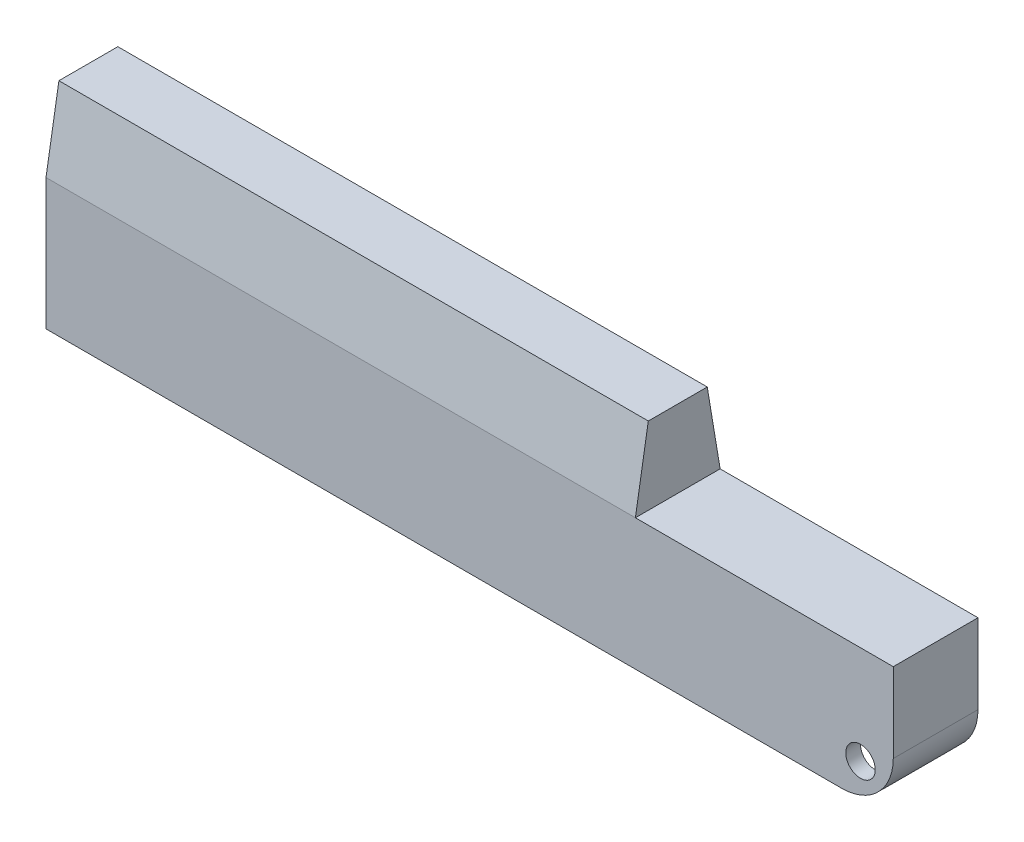
ISO-10303-21;
HEADER;
FILE_DESCRIPTION(('STEP AP214'),'2;1');
FILE_NAME('part.step','',(''),(''),'','','');
FILE_SCHEMA(('AUTOMOTIVE_DESIGN { 1 0 10303 214 1 1 1 1 }'));
ENDSEC;
DATA;
#1=APPLICATION_CONTEXT('core data for automotive mechanical design processes');
#2=APPLICATION_PROTOCOL_DEFINITION('international standard','automotive_design',2000,#1);
#3=PRODUCT_CONTEXT('',#1,'mechanical');
#4=PRODUCT('Part','Part','',(#3));
#5=PRODUCT_RELATED_PRODUCT_CATEGORY('part','',(#4));
#6=PRODUCT_DEFINITION_FORMATION('','',#4);
#7=PRODUCT_DEFINITION_CONTEXT('part definition',#1,'design');
#8=PRODUCT_DEFINITION('design','',#6,#7);
#9=PRODUCT_DEFINITION_SHAPE('','',#8);
#10=(LENGTH_UNIT() NAMED_UNIT(*) SI_UNIT(.MILLI.,.METRE.));
#11=(NAMED_UNIT(*) PLANE_ANGLE_UNIT() SI_UNIT($,.RADIAN.));
#12=(NAMED_UNIT(*) SI_UNIT($,.STERADIAN.) SOLID_ANGLE_UNIT());
#13=UNCERTAINTY_MEASURE_WITH_UNIT(LENGTH_MEASURE(1.E-05),#10,'distance_accuracy_value','');
#14=(GEOMETRIC_REPRESENTATION_CONTEXT(3) GLOBAL_UNCERTAINTY_ASSIGNED_CONTEXT((#13)) GLOBAL_UNIT_ASSIGNED_CONTEXT((#10,
#11,#12)) REPRESENTATION_CONTEXT('',''));
#15=CARTESIAN_POINT('',(0.,0.,0.));
#16=DIRECTION('',(0.,0.,1.));
#17=DIRECTION('',(1.,0.,0.));
#18=AXIS2_PLACEMENT_3D('',#15,#16,#17);
#19=CARTESIAN_POINT('',(-44.,111.253089844732,3.75));
#20=DIRECTION('',(0.,0.,1.));
#21=DIRECTION('',(1.,0.,0.));
#22=AXIS2_PLACEMENT_3D('',#19,#20,#21);
#23=PLANE('',#22);
#24=CARTESIAN_POINT('',(64.5500000000001,-13.35,3.75000000000001));
#25=DIRECTION('',(0.,0.,1.));
#26=DIRECTION('',(1.,0.,0.));
#27=AXIS2_PLACEMENT_3D('',#24,#25,#26);
#28=CIRCLE('',#27,2.);
#29=CARTESIAN_POINT('',(66.5500000000001,-13.35,3.75000000000001));
#30=VERTEX_POINT('',#29);
#31=EDGE_CURVE('E257',#30,#30,#28,.F.);
#32=ORIENTED_EDGE('',*,*,#31,.F.);
#33=EDGE_LOOP('',(#32));
#34=FACE_BOUND('',#33,.T.);
#35=DIRECTION('',(0.,-1.,0.));
#36=VECTOR('',#35,1.);
#37=CARTESIAN_POINT('',(67.,111.253089844732,3.75000000000001));
#38=LINE('',#37,#36);
#39=CARTESIAN_POINT('',(67.,-7.99999999999999,3.75000000000001));
#40=VERTEX_POINT('',#39);
#41=CARTESIAN_POINT('',(67.,-15.6989794855664,3.75000000000001));
#42=VERTEX_POINT('',#41);
#43=EDGE_CURVE('E228',#40,#42,#38,.T.);
#44=ORIENTED_EDGE('',*,*,#43,.T.);
#45=CARTESIAN_POINT('',(62.,-10.8,3.75000000000001));
#46=DIRECTION('',(0.,0.,1.));
#47=DIRECTION('',(1.,0.,0.));
#48=AXIS2_PLACEMENT_3D('',#45,#46,#47);
#49=CIRCLE('',#48,7.);
#50=CARTESIAN_POINT('',(62.,-17.8,3.75000000000001));
#51=VERTEX_POINT('',#50);
#52=EDGE_CURVE('E57',#42,#51,#49,.F.);
#53=ORIENTED_EDGE('',*,*,#52,.T.);
#54=DIRECTION('',(-1.,0.,0.));
#55=VECTOR('',#54,1.);
#56=CARTESIAN_POINT('',(-44.,-17.8,3.75));
#57=LINE('',#56,#55);
#58=CARTESIAN_POINT('',(-44.,-17.8,3.75));
#59=VERTEX_POINT('',#58);
#60=EDGE_CURVE('E191',#51,#59,#57,.T.);
#61=ORIENTED_EDGE('',*,*,#60,.T.);
#62=DIRECTION('',(0.,-1.,0.));
#63=VECTOR('',#62,1.);
#64=CARTESIAN_POINT('',(-44.,111.253089844732,3.75));
#65=LINE('',#64,#63);
#66=CARTESIAN_POINT('',(-44.,-14.3,3.75));
#67=VERTEX_POINT('',#66);
#68=EDGE_CURVE('E181',#67,#59,#65,.T.);
#69=ORIENTED_EDGE('',*,*,#68,.F.);
#70=DIRECTION('',(1.,0.,0.));
#71=VECTOR('',#70,1.);
#72=CARTESIAN_POINT('',(-44.,-14.3,3.75));
#73=LINE('',#72,#71);
#74=CARTESIAN_POINT('',(11.5,-14.3,3.75000000000001));
#75=VERTEX_POINT('',#74);
#76=EDGE_CURVE('E197',#67,#75,#73,.T.);
#77=ORIENTED_EDGE('',*,*,#76,.T.);
#78=DIRECTION('',(0.,1.,0.));
#79=VECTOR('',#78,1.);
#80=CARTESIAN_POINT('',(11.5,-14.3,3.75000000000001));
#81=LINE('',#80,#79);
#82=CARTESIAN_POINT('',(11.5,-12.3,3.75000000000001));
#83=VERTEX_POINT('',#82);
#84=EDGE_CURVE('E186',#75,#83,#81,.T.);
#85=ORIENTED_EDGE('',*,*,#84,.T.);
#86=DIRECTION('',(-1.,0.,0.));
#87=VECTOR('',#86,1.);
#88=CARTESIAN_POINT('',(-44.,-12.3,3.75));
#89=LINE('',#88,#87);
#90=CARTESIAN_POINT('',(-44.,-12.3,3.75));
#91=VERTEX_POINT('',#90);
#92=EDGE_CURVE('E184',#83,#91,#89,.T.);
#93=ORIENTED_EDGE('',*,*,#92,.T.);
#94=CARTESIAN_POINT('',(-44.,-7.99999999999999,3.75));
#95=VERTEX_POINT('',#94);
#96=EDGE_CURVE('E169',#95,#91,#65,.T.);
#97=ORIENTED_EDGE('',*,*,#96,.F.);
#98=DIRECTION('',(-1.,0.,0.));
#99=VECTOR('',#98,1.);
#100=CARTESIAN_POINT('',(-44.,-7.99999999999999,3.75));
#101=LINE('',#100,#99);
#102=EDGE_CURVE('E215',#40,#95,#101,.T.);
#103=ORIENTED_EDGE('',*,*,#102,.F.);
#104=EDGE_LOOP('',(#44,#53,#61,#69,#77,#85,#93,#97,#103));
#105=FACE_BOUND('',#104,.T.);
#106=ADVANCED_FACE('F48',(#34,#105),#23,.F.);
#107=CARTESIAN_POINT('',(-44.,111.253089844732,-3.75));
#108=DIRECTION('',(0.,0.,-1.));
#109=DIRECTION('',(-1.,0.,0.));
#110=AXIS2_PLACEMENT_3D('',#107,#108,#109);
#111=PLANE('',#110);
#112=CARTESIAN_POINT('',(64.5500000000001,-13.35,-3.75));
#113=DIRECTION('',(0.,0.,-1.));
#114=DIRECTION('',(-1.,0.,0.));
#115=AXIS2_PLACEMENT_3D('',#112,#113,#114);
#116=CIRCLE('',#115,2.);
#117=CARTESIAN_POINT('',(62.5500000000001,-13.35,-3.75));
#118=VERTEX_POINT('',#117);
#119=EDGE_CURVE('E244',#118,#118,#116,.F.);
#120=ORIENTED_EDGE('',*,*,#119,.F.);
#121=EDGE_LOOP('',(#120));
#122=FACE_BOUND('',#121,.T.);
#123=DIRECTION('',(1.,0.,0.));
#124=VECTOR('',#123,1.);
#125=CARTESIAN_POINT('',(-44.,-17.8,-3.75));
#126=LINE('',#125,#124);
#127=CARTESIAN_POINT('',(-44.,-17.8,-3.75));
#128=VERTEX_POINT('',#127);
#129=CARTESIAN_POINT('',(62.,-17.8,-3.75));
#130=VERTEX_POINT('',#129);
#131=EDGE_CURVE('E212',#128,#130,#126,.T.);
#132=ORIENTED_EDGE('',*,*,#131,.T.);
#133=CARTESIAN_POINT('',(62.,-10.8,-3.75));
#134=DIRECTION('',(0.,0.,-1.));
#135=DIRECTION('',(-1.,0.,0.));
#136=AXIS2_PLACEMENT_3D('',#133,#134,#135);
#137=CIRCLE('',#136,7.);
#138=CARTESIAN_POINT('',(67.,-15.6989794855664,-3.75));
#139=VERTEX_POINT('',#138);
#140=EDGE_CURVE('E72',#130,#139,#137,.F.);
#141=ORIENTED_EDGE('',*,*,#140,.T.);
#142=DIRECTION('',(0.,-1.,0.));
#143=VECTOR('',#142,1.);
#144=CARTESIAN_POINT('',(67.,111.253089844732,-3.75));
#145=LINE('',#144,#143);
#146=CARTESIAN_POINT('',(67.,-7.99999999999999,-3.75));
#147=VERTEX_POINT('',#146);
#148=EDGE_CURVE('E229',#147,#139,#145,.T.);
#149=ORIENTED_EDGE('',*,*,#148,.F.);
#150=DIRECTION('',(1.,0.,0.));
#151=VECTOR('',#150,1.);
#152=CARTESIAN_POINT('',(-44.,-7.99999999999999,-3.75));
#153=LINE('',#152,#151);
#154=CARTESIAN_POINT('',(-44.,-7.99999999999999,-3.75));
#155=VERTEX_POINT('',#154);
#156=EDGE_CURVE('E230',#155,#147,#153,.T.);
#157=ORIENTED_EDGE('',*,*,#156,.F.);
#158=DIRECTION('',(0.,-1.,0.));
#159=VECTOR('',#158,1.);
#160=CARTESIAN_POINT('',(-44.,111.253089844732,-3.75));
#161=LINE('',#160,#159);
#162=CARTESIAN_POINT('',(-44.,-12.3,-3.75));
#163=VERTEX_POINT('',#162);
#164=EDGE_CURVE('E234',#155,#163,#161,.T.);
#165=ORIENTED_EDGE('',*,*,#164,.T.);
#166=DIRECTION('',(-1.,0.,0.));
#167=VECTOR('',#166,1.);
#168=CARTESIAN_POINT('',(-44.,-12.3,-3.75));
#169=LINE('',#168,#167);
#170=CARTESIAN_POINT('',(11.5,-12.3,-3.75));
#171=VERTEX_POINT('',#170);
#172=EDGE_CURVE('E195',#171,#163,#169,.T.);
#173=ORIENTED_EDGE('',*,*,#172,.F.);
#174=DIRECTION('',(0.,1.,0.));
#175=VECTOR('',#174,1.);
#176=CARTESIAN_POINT('',(11.5,-14.3,-3.75));
#177=LINE('',#176,#175);
#178=CARTESIAN_POINT('',(11.5,-14.3,-3.75));
#179=VERTEX_POINT('',#178);
#180=EDGE_CURVE('E407',#179,#171,#177,.T.);
#181=ORIENTED_EDGE('',*,*,#180,.F.);
#182=DIRECTION('',(1.,0.,0.));
#183=VECTOR('',#182,1.);
#184=CARTESIAN_POINT('',(-44.,-14.3,-3.75));
#185=LINE('',#184,#183);
#186=CARTESIAN_POINT('',(-44.,-14.3,-3.75));
#187=VERTEX_POINT('',#186);
#188=EDGE_CURVE('E211',#187,#179,#185,.T.);
#189=ORIENTED_EDGE('',*,*,#188,.F.);
#190=EDGE_CURVE('E237',#187,#128,#161,.T.);
#191=ORIENTED_EDGE('',*,*,#190,.T.);
#192=EDGE_LOOP('',(#132,#141,#149,#157,#165,#173,#181,#189,#191));
#193=FACE_BOUND('',#192,.T.);
#194=ADVANCED_FACE('F393',(#122,#193),#111,.F.);
#195=CARTESIAN_POINT('',(-44.,111.253089844732,-3.75));
#196=DIRECTION('',(-1.,0.,0.));
#197=DIRECTION('',(0.,0.,1.));
#198=AXIS2_PLACEMENT_3D('',#195,#196,#197);
#199=PLANE('',#198);
#200=DIRECTION('',(0.,0.,-1.));
#201=VECTOR('',#200,1.);
#202=CARTESIAN_POINT('',(-44.,-14.3,59.286024344564));
#203=LINE('',#202,#201);
#204=EDGE_CURVE('E207',#67,#187,#203,.T.);
#205=ORIENTED_EDGE('',*,*,#204,.F.);
#206=ORIENTED_EDGE('',*,*,#68,.T.);
#207=DIRECTION('',(0.,0.,-1.));
#208=VECTOR('',#207,1.);
#209=CARTESIAN_POINT('',(-44.,-17.8,-3.75));
#210=LINE('',#209,#208);
#211=EDGE_CURVE('E216',#59,#128,#210,.T.);
#212=ORIENTED_EDGE('',*,*,#211,.T.);
#213=ORIENTED_EDGE('',*,*,#190,.F.);
#214=EDGE_LOOP('',(#205,#206,#212,#213));
#215=FACE_BOUND('',#214,.T.);
#216=ADVANCED_FACE('F398',(#215),#199,.F.);
#217=DIRECTION('',(0.,0.,-1.));
#218=VECTOR('',#217,1.);
#219=CARTESIAN_POINT('',(-44.,-12.3,59.286024344564));
#220=LINE('',#219,#218);
#221=EDGE_CURVE('E174',#91,#163,#220,.T.);
#222=ORIENTED_EDGE('',*,*,#221,.T.);
#223=ORIENTED_EDGE('',*,*,#164,.F.);
#224=DIRECTION('',(0.,0.,-1.));
#225=VECTOR('',#224,1.);
#226=CARTESIAN_POINT('',(-44.,-7.99999999999999,-3.75));
#227=LINE('',#226,#225);
#228=EDGE_CURVE('E177',#95,#155,#227,.T.);
#229=ORIENTED_EDGE('',*,*,#228,.F.);
#230=ORIENTED_EDGE('',*,*,#96,.T.);
#231=EDGE_LOOP('',(#222,#223,#229,#230));
#232=FACE_BOUND('',#231,.T.);
#233=ADVANCED_FACE('F171',(#232),#199,.F.);
#234=CARTESIAN_POINT('',(64.5500000000001,-13.35,-11.4068542494924));
#235=DIRECTION('',(0.,0.,1.));
#236=DIRECTION('',(1.,0.,0.));
#237=AXIS2_PLACEMENT_3D('',#234,#235,#236);
#238=CYLINDRICAL_SURFACE('',#237,2.);
#239=ORIENTED_EDGE('',*,*,#31,.T.);
#240=EDGE_LOOP('',(#239));
#241=FACE_BOUND('',#240,.T.);
#242=CARTESIAN_POINT('',(64.5500000000001,-13.35,5.75));
#243=DIRECTION('',(0.,0.,1.));
#244=DIRECTION('',(1.,0.,0.));
#245=AXIS2_PLACEMENT_3D('',#242,#243,#244);
#246=CIRCLE('',#245,2.);
#247=CARTESIAN_POINT('',(66.5500000000001,-13.35,5.75));
#248=VERTEX_POINT('',#247);
#249=EDGE_CURVE('E265',#248,#248,#246,.T.);
#250=ORIENTED_EDGE('',*,*,#249,.T.);
#251=EDGE_LOOP('',(#250));
#252=FACE_BOUND('',#251,.T.);
#253=ADVANCED_FACE('F458',(#241,#252),#238,.F.);
#254=CARTESIAN_POINT('',(-69.,-17.8,5.75));
#255=DIRECTION('',(0.,0.,1.));
#256=DIRECTION('',(1.,0.,0.));
#257=AXIS2_PLACEMENT_3D('',#254,#255,#256);
#258=PLANE('',#257);
#259=DIRECTION('',(1.,0.,0.));
#260=VECTOR('',#259,1.);
#261=CARTESIAN_POINT('',(-69.,-17.8,5.75));
#262=LINE('',#261,#260);
#263=CARTESIAN_POINT('',(-46.,-17.8,5.75));
#264=VERTEX_POINT('',#263);
#265=CARTESIAN_POINT('',(62.,-17.8,5.75));
#266=VERTEX_POINT('',#265);
#267=EDGE_CURVE('E276',#264,#266,#262,.T.);
#268=ORIENTED_EDGE('',*,*,#267,.T.);
#269=CARTESIAN_POINT('',(62.,-10.8,5.75));
#270=DIRECTION('',(0.,0.,1.));
#271=DIRECTION('',(1.,0.,0.));
#272=AXIS2_PLACEMENT_3D('',#269,#270,#271);
#273=CIRCLE('',#272,7.);
#274=CARTESIAN_POINT('',(69.,-10.8,5.75));
#275=VERTEX_POINT('',#274);
#276=EDGE_CURVE('E12',#266,#275,#273,.T.);
#277=ORIENTED_EDGE('',*,*,#276,.T.);
#278=DIRECTION('',(0.,1.,0.));
#279=VECTOR('',#278,1.);
#280=CARTESIAN_POINT('',(69.,-17.8,5.75));
#281=LINE('',#280,#279);
#282=CARTESIAN_POINT('',(69.,0.,5.75));
#283=VERTEX_POINT('',#282);
#284=EDGE_CURVE('E285',#275,#283,#281,.T.);
#285=ORIENTED_EDGE('',*,*,#284,.T.);
#286=DIRECTION('',(1.,0.,0.));
#287=VECTOR('',#286,1.);
#288=CARTESIAN_POINT('',(-69.,0.,5.75));
#289=LINE('',#288,#287);
#290=CARTESIAN_POINT('',(34.,0.,5.75));
#291=VERTEX_POINT('',#290);
#292=EDGE_CURVE('E275',#291,#283,#289,.T.);
#293=ORIENTED_EDGE('',*,*,#292,.F.);
#294=DIRECTION('',(-1.,0.,0.));
#295=VECTOR('',#294,1.);
#296=CARTESIAN_POINT('',(-69.,-2.32452945780892E-13,5.75));
#297=LINE('',#296,#295);
#298=CARTESIAN_POINT('',(-46.,-2.32452945780892E-13,5.75));
#299=VERTEX_POINT('',#298);
#300=EDGE_CURVE('E308',#291,#299,#297,.T.);
#301=ORIENTED_EDGE('',*,*,#300,.T.);
#302=DIRECTION('',(0.,-1.,0.));
#303=VECTOR('',#302,1.);
#304=CARTESIAN_POINT('',(-46.,25.7147817412476,5.75));
#305=LINE('',#304,#303);
#306=EDGE_CURVE('E262',#299,#264,#305,.T.);
#307=ORIENTED_EDGE('',*,*,#306,.T.);
#308=EDGE_LOOP('',(#268,#277,#285,#293,#301,#307));
#309=FACE_BOUND('',#308,.T.);
#310=ORIENTED_EDGE('',*,*,#249,.F.);
#311=EDGE_LOOP('',(#310));
#312=FACE_BOUND('',#311,.T.);
#313=ADVANCED_FACE('F366',(#309,#312),#258,.T.);
#314=CARTESIAN_POINT('',(-69.,-17.8,-5.75));
#315=DIRECTION('',(0.,0.,1.));
#316=DIRECTION('',(1.,0.,0.));
#317=AXIS2_PLACEMENT_3D('',#314,#315,#316);
#318=PLANE('',#317);
#319=CARTESIAN_POINT('',(64.5500000000001,-13.35,-5.75));
#320=DIRECTION('',(0.,0.,1.));
#321=DIRECTION('',(1.,0.,0.));
#322=AXIS2_PLACEMENT_3D('',#319,#320,#321);
#323=CIRCLE('',#322,2.);
#324=CARTESIAN_POINT('',(66.5500000000001,-13.35,-5.75));
#325=VERTEX_POINT('',#324);
#326=EDGE_CURVE('E271',#325,#325,#323,.F.);
#327=ORIENTED_EDGE('',*,*,#326,.F.);
#328=EDGE_LOOP('',(#327));
#329=FACE_BOUND('',#328,.T.);
#330=DIRECTION('',(0.,1.,0.));
#331=VECTOR('',#330,1.);
#332=CARTESIAN_POINT('',(69.,-17.8,-5.75));
#333=LINE('',#332,#331);
#334=CARTESIAN_POINT('',(69.,-10.8,-5.75));
#335=VERTEX_POINT('',#334);
#336=CARTESIAN_POINT('',(69.,0.,-5.75));
#337=VERTEX_POINT('',#336);
#338=EDGE_CURVE('E296',#335,#337,#333,.T.);
#339=ORIENTED_EDGE('',*,*,#338,.F.);
#340=CARTESIAN_POINT('',(62.,-10.8,-5.75));
#341=DIRECTION('',(0.,0.,1.));
#342=DIRECTION('',(1.,0.,0.));
#343=AXIS2_PLACEMENT_3D('',#340,#341,#342);
#344=CIRCLE('',#343,7.);
#345=CARTESIAN_POINT('',(62.,-17.8,-5.75));
#346=VERTEX_POINT('',#345);
#347=EDGE_CURVE('E338',#335,#346,#344,.F.);
#348=ORIENTED_EDGE('',*,*,#347,.T.);
#349=DIRECTION('',(1.,0.,0.));
#350=VECTOR('',#349,1.);
#351=CARTESIAN_POINT('',(-69.,-17.8,-5.75));
#352=LINE('',#351,#350);
#353=CARTESIAN_POINT('',(-46.,-17.8,-5.75));
#354=VERTEX_POINT('',#353);
#355=EDGE_CURVE('E280',#354,#346,#352,.T.);
#356=ORIENTED_EDGE('',*,*,#355,.F.);
#357=DIRECTION('',(0.,-1.,0.));
#358=VECTOR('',#357,1.);
#359=CARTESIAN_POINT('',(-46.,25.7147817412476,-5.75));
#360=LINE('',#359,#358);
#361=CARTESIAN_POINT('',(-46.,-2.46330733588707E-13,-5.75));
#362=VERTEX_POINT('',#361);
#363=EDGE_CURVE('E261',#362,#354,#360,.T.);
#364=ORIENTED_EDGE('',*,*,#363,.F.);
#365=DIRECTION('',(1.,0.,0.));
#366=VECTOR('',#365,1.);
#367=CARTESIAN_POINT('',(34.,-2.46601784131828E-13,-5.75));
#368=LINE('',#367,#366);
#369=CARTESIAN_POINT('',(34.,0.,-5.75));
#370=VERTEX_POINT('',#369);
#371=EDGE_CURVE('E322',#362,#370,#368,.T.);
#372=ORIENTED_EDGE('',*,*,#371,.T.);
#373=DIRECTION('',(1.,0.,0.));
#374=VECTOR('',#373,1.);
#375=CARTESIAN_POINT('',(-69.,0.,-5.75));
#376=LINE('',#375,#374);
#377=EDGE_CURVE('E281',#370,#337,#376,.T.);
#378=ORIENTED_EDGE('',*,*,#377,.T.);
#379=EDGE_LOOP('',(#339,#348,#356,#364,#372,#378));
#380=FACE_BOUND('',#379,.T.);
#381=ADVANCED_FACE('F391',(#329,#380),#318,.F.);
#382=CARTESIAN_POINT('',(69.,-17.8,5.75));
#383=DIRECTION('',(1.,0.,0.));
#384=DIRECTION('',(0.,0.,-1.));
#385=AXIS2_PLACEMENT_3D('',#382,#383,#384);
#386=PLANE('',#385);
#387=ORIENTED_EDGE('',*,*,#284,.F.);
#388=DIRECTION('',(0.,0.,-1.));
#389=VECTOR('',#388,1.);
#390=CARTESIAN_POINT('',(69.,-10.8,-5.75));
#391=LINE('',#390,#389);
#392=EDGE_CURVE('E328',#275,#335,#391,.T.);
#393=ORIENTED_EDGE('',*,*,#392,.T.);
#394=ORIENTED_EDGE('',*,*,#338,.T.);
#395=DIRECTION('',(0.,0.,-1.));
#396=VECTOR('',#395,1.);
#397=CARTESIAN_POINT('',(69.,0.,5.75));
#398=LINE('',#397,#396);
#399=EDGE_CURVE('E289',#283,#337,#398,.T.);
#400=ORIENTED_EDGE('',*,*,#399,.F.);
#401=EDGE_LOOP('',(#387,#393,#394,#400));
#402=FACE_BOUND('',#401,.T.);
#403=ADVANCED_FACE('F371',(#402),#386,.T.);
#404=CARTESIAN_POINT('',(0.,-17.8,0.));
#405=DIRECTION('',(0.,1.,0.));
#406=DIRECTION('',(0.,0.,1.));
#407=AXIS2_PLACEMENT_3D('',#404,#405,#406);
#408=PLANE('',#407);
#409=ORIENTED_EDGE('',*,*,#355,.T.);
#410=DIRECTION('',(0.,0.,-1.));
#411=VECTOR('',#410,1.);
#412=CARTESIAN_POINT('',(62.,-17.8,5.75));
#413=LINE('',#412,#411);
#414=EDGE_CURVE('E344',#346,#130,#413,.F.);
#415=ORIENTED_EDGE('',*,*,#414,.T.);
#416=ORIENTED_EDGE('',*,*,#131,.F.);
#417=ORIENTED_EDGE('',*,*,#211,.F.);
#418=ORIENTED_EDGE('',*,*,#60,.F.);
#419=DIRECTION('',(0.,0.,-1.));
#420=VECTOR('',#419,1.);
#421=CARTESIAN_POINT('',(62.,-17.8,5.75));
#422=LINE('',#421,#420);
#423=EDGE_CURVE('E341',#51,#266,#422,.F.);
#424=ORIENTED_EDGE('',*,*,#423,.T.);
#425=ORIENTED_EDGE('',*,*,#267,.F.);
#426=DIRECTION('',(0.,0.,1.));
#427=VECTOR('',#426,1.);
#428=CARTESIAN_POINT('',(-46.,-17.8,5.75));
#429=LINE('',#428,#427);
#430=EDGE_CURVE('E253',#354,#264,#429,.T.);
#431=ORIENTED_EDGE('',*,*,#430,.F.);
#432=EDGE_LOOP('',(#409,#415,#416,#417,#418,#424,#425,#431));
#433=FACE_BOUND('',#432,.T.);
#434=ADVANCED_FACE('F359',(#433),#408,.F.);
#435=CARTESIAN_POINT('',(0.,0.,0.));
#436=DIRECTION('',(0.,1.,0.));
#437=DIRECTION('',(0.,0.,1.));
#438=AXIS2_PLACEMENT_3D('',#435,#436,#437);
#439=PLANE('',#438);
#440=DIRECTION('',(0.,0.,-1.));
#441=VECTOR('',#440,1.);
#442=CARTESIAN_POINT('',(34.,0.,-5.75));
#443=LINE('',#442,#441);
#444=EDGE_CURVE('E249',#291,#370,#443,.T.);
#445=ORIENTED_EDGE('',*,*,#444,.F.);
#446=ORIENTED_EDGE('',*,*,#292,.T.);
#447=ORIENTED_EDGE('',*,*,#399,.T.);
#448=ORIENTED_EDGE('',*,*,#377,.F.);
#449=EDGE_LOOP('',(#445,#446,#447,#448));
#450=FACE_BOUND('',#449,.T.);
#451=ADVANCED_FACE('F376',(#450),#439,.T.);
#452=ORIENTED_EDGE('',*,*,#119,.T.);
#453=EDGE_LOOP('',(#452));
#454=FACE_BOUND('',#453,.T.);
#455=ORIENTED_EDGE('',*,*,#326,.T.);
#456=EDGE_LOOP('',(#455));
#457=FACE_BOUND('',#456,.T.);
#458=ADVANCED_FACE('F454',(#454,#457),#238,.F.);
#459=CARTESIAN_POINT('',(-46.,25.7147817412476,5.75));
#460=DIRECTION('',(1.,0.,0.));
#461=DIRECTION('',(0.,0.,-1.));
#462=AXIS2_PLACEMENT_3D('',#459,#460,#461);
#463=PLANE('',#462);
#464=DIRECTION('',(0.,0.,1.));
#465=VECTOR('',#464,1.);
#466=CARTESIAN_POINT('',(-46.,10.5,-5.75));
#467=LINE('',#466,#465);
#468=CARTESIAN_POINT('',(-46.,10.5,-4.));
#469=VERTEX_POINT('',#468);
#470=CARTESIAN_POINT('',(-46.,10.5,4.));
#471=VERTEX_POINT('',#470);
#472=EDGE_CURVE('E245',#469,#471,#467,.T.);
#473=ORIENTED_EDGE('',*,*,#472,.F.);
#474=DIRECTION('',(0.,-0.986393923832144,-0.164398987305354));
#475=VECTOR('',#474,1.);
#476=CARTESIAN_POINT('',(-46.,10.5,-4.));
#477=LINE('',#476,#475);
#478=EDGE_CURVE('E319',#469,#362,#477,.T.);
#479=ORIENTED_EDGE('',*,*,#478,.T.);
#480=ORIENTED_EDGE('',*,*,#363,.T.);
#481=ORIENTED_EDGE('',*,*,#430,.T.);
#482=ORIENTED_EDGE('',*,*,#306,.F.);
#483=DIRECTION('',(0.,-0.986393923832144,0.164398987305354));
#484=VECTOR('',#483,1.);
#485=CARTESIAN_POINT('',(-46.,10.5,4.));
#486=LINE('',#485,#484);
#487=EDGE_CURVE('E311',#299,#471,#486,.F.);
#488=ORIENTED_EDGE('',*,*,#487,.T.);
#489=EDGE_LOOP('',(#473,#479,#480,#481,#482,#488));
#490=FACE_BOUND('',#489,.T.);
#491=ADVANCED_FACE('F385',(#490),#463,.F.);
#492=CARTESIAN_POINT('',(34.,10.5,-5.75));
#493=DIRECTION('',(-1.,0.,0.));
#494=DIRECTION('',(0.,0.,1.));
#495=AXIS2_PLACEMENT_3D('',#492,#493,#494);
#496=PLANE('',#495);
#497=ORIENTED_EDGE('',*,*,#444,.T.);
#498=DIRECTION('',(0.,0.986393923832144,0.164398987305354));
#499=VECTOR('',#498,1.);
#500=CARTESIAN_POINT('',(34.,10.5,-4.));
#501=LINE('',#500,#499);
#502=CARTESIAN_POINT('',(34.,10.5,-4.));
#503=VERTEX_POINT('',#502);
#504=EDGE_CURVE('E325',#370,#503,#501,.T.);
#505=ORIENTED_EDGE('',*,*,#504,.T.);
#506=DIRECTION('',(0.,0.,-1.));
#507=VECTOR('',#506,1.);
#508=CARTESIAN_POINT('',(34.,10.5,-5.75));
#509=LINE('',#508,#507);
#510=CARTESIAN_POINT('',(34.,10.5,4.));
#511=VERTEX_POINT('',#510);
#512=EDGE_CURVE('E248',#511,#503,#509,.T.);
#513=ORIENTED_EDGE('',*,*,#512,.F.);
#514=DIRECTION('',(0.,0.986393923832144,-0.164398987305354));
#515=VECTOR('',#514,1.);
#516=CARTESIAN_POINT('',(34.,10.5,4.));
#517=LINE('',#516,#515);
#518=EDGE_CURVE('E305',#511,#291,#517,.F.);
#519=ORIENTED_EDGE('',*,*,#518,.T.);
#520=EDGE_LOOP('',(#497,#505,#513,#519));
#521=FACE_BOUND('',#520,.T.);
#522=ADVANCED_FACE('F447',(#521),#496,.F.);
#523=CARTESIAN_POINT('',(0.,10.5,0.));
#524=DIRECTION('',(0.,1.,0.));
#525=DIRECTION('',(0.,0.,1.));
#526=AXIS2_PLACEMENT_3D('',#523,#524,#525);
#527=PLANE('',#526);
#528=ORIENTED_EDGE('',*,*,#512,.T.);
#529=DIRECTION('',(-1.,0.,0.));
#530=VECTOR('',#529,1.);
#531=CARTESIAN_POINT('',(-46.,10.5,-4.));
#532=LINE('',#531,#530);
#533=EDGE_CURVE('E315',#503,#469,#532,.T.);
#534=ORIENTED_EDGE('',*,*,#533,.T.);
#535=ORIENTED_EDGE('',*,*,#472,.T.);
#536=DIRECTION('',(1.,0.,0.));
#537=VECTOR('',#536,1.);
#538=CARTESIAN_POINT('',(0.,10.5,4.));
#539=LINE('',#538,#537);
#540=EDGE_CURVE('E299',#471,#511,#539,.T.);
#541=ORIENTED_EDGE('',*,*,#540,.T.);
#542=EDGE_LOOP('',(#528,#534,#535,#541));
#543=FACE_BOUND('',#542,.T.);
#544=ADVANCED_FACE('F444',(#543),#527,.T.);
#545=CARTESIAN_POINT('',(0.,10.5,4.));
#546=DIRECTION('',(0.,-0.164398987305354,-0.986393923832144));
#547=DIRECTION('',(1.,0.,0.));
#548=AXIS2_PLACEMENT_3D('',#545,#546,#547);
#549=PLANE('',#548);
#550=ORIENTED_EDGE('',*,*,#487,.F.);
#551=ORIENTED_EDGE('',*,*,#300,.F.);
#552=ORIENTED_EDGE('',*,*,#518,.F.);
#553=ORIENTED_EDGE('',*,*,#540,.F.);
#554=EDGE_LOOP('',(#550,#551,#552,#553));
#555=FACE_BOUND('',#554,.T.);
#556=ADVANCED_FACE('F381',(#555),#549,.F.);
#557=CARTESIAN_POINT('',(0.,10.5,-4.));
#558=DIRECTION('',(0.,0.164398987305354,-0.986393923832144));
#559=DIRECTION('',(1.,0.,0.));
#560=AXIS2_PLACEMENT_3D('',#557,#558,#559);
#561=PLANE('',#560);
#562=ORIENTED_EDGE('',*,*,#504,.F.);
#563=ORIENTED_EDGE('',*,*,#371,.F.);
#564=ORIENTED_EDGE('',*,*,#478,.F.);
#565=ORIENTED_EDGE('',*,*,#533,.F.);
#566=EDGE_LOOP('',(#562,#563,#564,#565));
#567=FACE_BOUND('',#566,.T.);
#568=ADVANCED_FACE('F430',(#567),#561,.T.);
#569=CARTESIAN_POINT('',(0.,-8.,0.));
#570=DIRECTION('',(0.,1.,0.));
#571=DIRECTION('',(0.,0.,1.));
#572=AXIS2_PLACEMENT_3D('',#569,#570,#571);
#573=PLANE('',#572);
#574=DIRECTION('',(0.,0.,1.));
#575=VECTOR('',#574,1.);
#576=CARTESIAN_POINT('',(67.,-7.99999999999999,-3.75));
#577=LINE('',#576,#575);
#578=EDGE_CURVE('E224',#147,#40,#577,.T.);
#579=ORIENTED_EDGE('',*,*,#578,.T.);
#580=ORIENTED_EDGE('',*,*,#102,.T.);
#581=ORIENTED_EDGE('',*,*,#228,.T.);
#582=ORIENTED_EDGE('',*,*,#156,.T.);
#583=EDGE_LOOP('',(#579,#580,#581,#582));
#584=FACE_BOUND('',#583,.T.);
#585=ADVANCED_FACE('F419',(#584),#573,.F.);
#586=CARTESIAN_POINT('',(67.,111.253089844732,-3.75));
#587=DIRECTION('',(1.,0.,0.));
#588=DIRECTION('',(0.,0.,-1.));
#589=AXIS2_PLACEMENT_3D('',#586,#587,#588);
#590=PLANE('',#589);
#591=ORIENTED_EDGE('',*,*,#148,.T.);
#592=DIRECTION('',(0.,0.,1.));
#593=VECTOR('',#592,1.);
#594=CARTESIAN_POINT('',(67.,-15.6989794855664,-3.75));
#595=LINE('',#594,#593);
#596=EDGE_CURVE('E64',#139,#42,#595,.T.);
#597=ORIENTED_EDGE('',*,*,#596,.T.);
#598=ORIENTED_EDGE('',*,*,#43,.F.);
#599=ORIENTED_EDGE('',*,*,#578,.F.);
#600=EDGE_LOOP('',(#591,#597,#598,#599));
#601=FACE_BOUND('',#600,.T.);
#602=ADVANCED_FACE('F420',(#601),#590,.F.);
#603=CARTESIAN_POINT('',(-44.,-14.3,59.286024344564));
#604=DIRECTION('',(0.,1.,0.));
#605=DIRECTION('',(-1.,0.,0.));
#606=AXIS2_PLACEMENT_3D('',#603,#604,#605);
#607=PLANE('',#606);
#608=ORIENTED_EDGE('',*,*,#76,.F.);
#609=ORIENTED_EDGE('',*,*,#204,.T.);
#610=ORIENTED_EDGE('',*,*,#188,.T.);
#611=DIRECTION('',(0.,0.,-1.));
#612=VECTOR('',#611,1.);
#613=CARTESIAN_POINT('',(11.5,-14.3,59.286024344564));
#614=LINE('',#613,#612);
#615=EDGE_CURVE('E404',#75,#179,#614,.T.);
#616=ORIENTED_EDGE('',*,*,#615,.F.);
#617=EDGE_LOOP('',(#608,#609,#610,#616));
#618=FACE_BOUND('',#617,.T.);
#619=ADVANCED_FACE('F415',(#618),#607,.F.);
#620=CARTESIAN_POINT('',(11.5,-14.3,59.286024344564));
#621=DIRECTION('',(-1.,0.,0.));
#622=DIRECTION('',(0.,-1.,0.));
#623=AXIS2_PLACEMENT_3D('',#620,#621,#622);
#624=PLANE('',#623);
#625=ORIENTED_EDGE('',*,*,#84,.F.);
#626=ORIENTED_EDGE('',*,*,#615,.T.);
#627=ORIENTED_EDGE('',*,*,#180,.T.);
#628=DIRECTION('',(0.,0.,-1.));
#629=VECTOR('',#628,1.);
#630=CARTESIAN_POINT('',(11.5,-12.3,59.286024344564));
#631=LINE('',#630,#629);
#632=EDGE_CURVE('E202',#83,#171,#631,.T.);
#633=ORIENTED_EDGE('',*,*,#632,.F.);
#634=EDGE_LOOP('',(#625,#626,#627,#633));
#635=FACE_BOUND('',#634,.T.);
#636=ADVANCED_FACE('F416',(#635),#624,.F.);
#637=CARTESIAN_POINT('',(-44.,-12.3,59.286024344564));
#638=DIRECTION('',(0.,-1.,0.));
#639=DIRECTION('',(1.,0.,0.));
#640=AXIS2_PLACEMENT_3D('',#637,#638,#639);
#641=PLANE('',#640);
#642=ORIENTED_EDGE('',*,*,#92,.F.);
#643=ORIENTED_EDGE('',*,*,#632,.T.);
#644=ORIENTED_EDGE('',*,*,#172,.T.);
#645=ORIENTED_EDGE('',*,*,#221,.F.);
#646=EDGE_LOOP('',(#642,#643,#644,#645));
#647=FACE_BOUND('',#646,.T.);
#648=ADVANCED_FACE('F194',(#647),#641,.F.);
#649=CARTESIAN_POINT('',(62.,-10.8,5.75));
#650=DIRECTION('',(0.,0.,1.));
#651=DIRECTION('',(1.,0.,0.));
#652=AXIS2_PLACEMENT_3D('',#649,#650,#651);
#653=CYLINDRICAL_SURFACE('',#652,7.);
#654=ORIENTED_EDGE('',*,*,#140,.F.);
#655=ORIENTED_EDGE('',*,*,#414,.F.);
#656=ORIENTED_EDGE('',*,*,#347,.F.);
#657=ORIENTED_EDGE('',*,*,#392,.F.);
#658=ORIENTED_EDGE('',*,*,#276,.F.);
#659=ORIENTED_EDGE('',*,*,#423,.F.);
#660=ORIENTED_EDGE('',*,*,#52,.F.);
#661=ORIENTED_EDGE('',*,*,#596,.F.);
#662=EDGE_LOOP('',(#654,#655,#656,#657,#658,#659,#660,#661));
#663=FACE_BOUND('',#662,.T.);
#664=ADVANCED_FACE('F50',(#663),#653,.T.);
#665=CLOSED_SHELL('',(#106,#194,#216,#233,#253,#313,#381,#403,#434,#451,#458,#491,#522,#544,
#556,#568,#585,#602,#619,#636,#648,#664));
#666=MANIFOLD_SOLID_BREP('B2',#665);
#667=ADVANCED_BREP_SHAPE_REPRESENTATION('',(#18,#666),#14);
#668=SHAPE_DEFINITION_REPRESENTATION(#9,#667);
ENDSEC;
END-ISO-10303-21;
